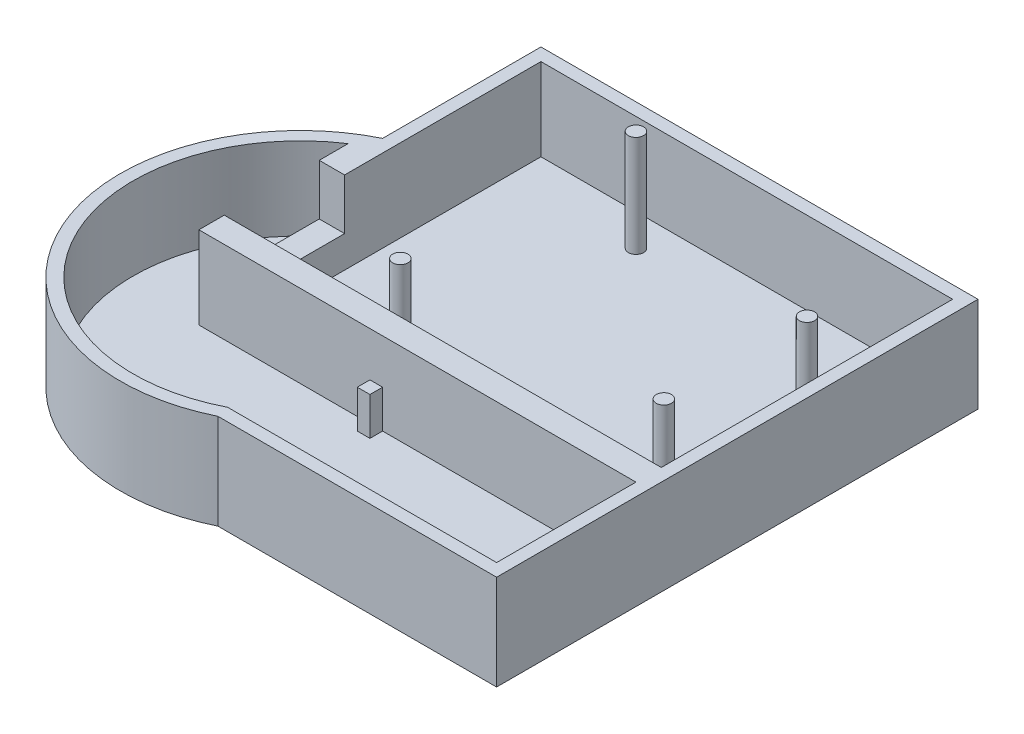
ISO-10303-21;
HEADER;
FILE_DESCRIPTION(('STEP AP214'),'2;1');
FILE_NAME('part.step','',(''),(''),'','','');
FILE_SCHEMA(('AUTOMOTIVE_DESIGN { 1 0 10303 214 1 1 1 1 }'));
ENDSEC;
DATA;
#1=APPLICATION_CONTEXT('core data for automotive mechanical design processes');
#2=APPLICATION_PROTOCOL_DEFINITION('international standard','automotive_design',2000,#1);
#3=PRODUCT_CONTEXT('',#1,'mechanical');
#4=PRODUCT('Part','Part','',(#3));
#5=PRODUCT_RELATED_PRODUCT_CATEGORY('part','',(#4));
#6=PRODUCT_DEFINITION_FORMATION('','',#4);
#7=PRODUCT_DEFINITION_CONTEXT('part definition',#1,'design');
#8=PRODUCT_DEFINITION('design','',#6,#7);
#9=PRODUCT_DEFINITION_SHAPE('','',#8);
#10=(LENGTH_UNIT() NAMED_UNIT(*) SI_UNIT(.MILLI.,.METRE.));
#11=(NAMED_UNIT(*) PLANE_ANGLE_UNIT() SI_UNIT($,.RADIAN.));
#12=(NAMED_UNIT(*) SI_UNIT($,.STERADIAN.) SOLID_ANGLE_UNIT());
#13=UNCERTAINTY_MEASURE_WITH_UNIT(LENGTH_MEASURE(1.E-05),#10,'distance_accuracy_value','');
#14=(GEOMETRIC_REPRESENTATION_CONTEXT(3) GLOBAL_UNCERTAINTY_ASSIGNED_CONTEXT((#13)) GLOBAL_UNIT_ASSIGNED_CONTEXT((#10,
#11,#12)) REPRESENTATION_CONTEXT('',''));
#15=CARTESIAN_POINT('',(0.,0.,0.));
#16=DIRECTION('',(0.,0.,1.));
#17=DIRECTION('',(1.,0.,0.));
#18=AXIS2_PLACEMENT_3D('',#15,#16,#17);
#19=CARTESIAN_POINT('',(48.768,25.4,0.));
#20=DIRECTION('',(-1.,0.,0.));
#21=DIRECTION('',(0.,0.,1.));
#22=AXIS2_PLACEMENT_3D('',#19,#20,#21);
#23=PLANE('',#22);
#24=DIRECTION('',(0.,0.,-1.));
#25=VECTOR('',#24,1.);
#26=CARTESIAN_POINT('',(48.768,19.0754,0.));
#27=LINE('',#26,#25);
#28=CARTESIAN_POINT('',(48.768,19.0754,60.96));
#29=VERTEX_POINT('',#28);
#30=CARTESIAN_POINT('',(48.768,19.0754,2.53999999999998));
#31=VERTEX_POINT('',#30);
#32=EDGE_CURVE('E208',#29,#31,#27,.T.);
#33=ORIENTED_EDGE('',*,*,#32,.T.);
#34=DIRECTION('',(0.,-1.,0.));
#35=VECTOR('',#34,1.);
#36=CARTESIAN_POINT('',(48.768,7.62,2.54000000000001));
#37=LINE('',#36,#35);
#38=CARTESIAN_POINT('',(48.768,2.54,2.54000000000001));
#39=VERTEX_POINT('',#38);
#40=EDGE_CURVE('E50',#31,#39,#37,.T.);
#41=ORIENTED_EDGE('',*,*,#40,.T.);
#42=DIRECTION('',(0.,0.,-1.));
#43=VECTOR('',#42,1.);
#44=CARTESIAN_POINT('',(48.768,2.54,0.));
#45=LINE('',#44,#43);
#46=CARTESIAN_POINT('',(48.768,2.54,60.96));
#47=VERTEX_POINT('',#46);
#48=EDGE_CURVE('E269',#47,#39,#45,.T.);
#49=ORIENTED_EDGE('',*,*,#48,.F.);
#50=DIRECTION('',(0.,-1.,0.));
#51=VECTOR('',#50,1.);
#52=CARTESIAN_POINT('',(48.768,25.4,60.96));
#53=LINE('',#52,#51);
#54=EDGE_CURVE('E271',#29,#47,#53,.T.);
#55=ORIENTED_EDGE('',*,*,#54,.F.);
#56=EDGE_LOOP('',(#33,#41,#49,#55));
#57=FACE_BOUND('',#56,.T.);
#58=ADVANCED_FACE('F35',(#57),#23,.T.);
#59=CARTESIAN_POINT('',(-20.447,0.,64.135));
#60=DIRECTION('',(0.,-1.,0.));
#61=DIRECTION('',(0.,0.,-1.));
#62=AXIS2_PLACEMENT_3D('',#59,#60,#61);
#63=PLANE('',#62);
#64=DIRECTION('',(-1.,0.,0.));
#65=VECTOR('',#64,1.);
#66=CARTESIAN_POINT('',(51.308,0.,0.));
#67=LINE('',#66,#65);
#68=CARTESIAN_POINT('',(51.308,0.,0.));
#69=VERTEX_POINT('',#68);
#70=CARTESIAN_POINT('',(-36.322,0.,0.));
#71=VERTEX_POINT('',#70);
#72=EDGE_CURVE('E270',#69,#71,#67,.T.);
#73=ORIENTED_EDGE('',*,*,#72,.F.);
#74=DIRECTION('',(0.,0.,1.));
#75=VECTOR('',#74,1.);
#76=CARTESIAN_POINT('',(51.308,0.,63.5));
#77=LINE('',#76,#75);
#78=CARTESIAN_POINT('',(51.308,0.,96.52));
#79=VERTEX_POINT('',#78);
#80=EDGE_CURVE('E195',#69,#79,#77,.T.);
#81=ORIENTED_EDGE('',*,*,#80,.T.);
#82=DIRECTION('',(1.,0.,0.));
#83=VECTOR('',#82,1.);
#84=CARTESIAN_POINT('',(-4.57199999999994,0.,96.52));
#85=LINE('',#84,#83);
#86=CARTESIAN_POINT('',(-4.57199999999995,0.,96.52));
#87=VERTEX_POINT('',#86);
#88=EDGE_CURVE('E357',#87,#79,#85,.T.);
#89=ORIENTED_EDGE('',*,*,#88,.F.);
#90=CARTESIAN_POINT('',(-20.447,0.,64.135));
#91=DIRECTION('',(0.,-1.,0.));
#92=DIRECTION('',(0.,0.,-1.));
#93=AXIS2_PLACEMENT_3D('',#90,#91,#92);
#94=CIRCLE('',#93,36.0666584257538);
#95=CARTESIAN_POINT('',(-36.322,0.,31.75));
#96=VERTEX_POINT('',#95);
#97=EDGE_CURVE('E354',#87,#96,#94,.T.);
#98=ORIENTED_EDGE('',*,*,#97,.T.);
#99=DIRECTION('',(0.,0.,1.));
#100=VECTOR('',#99,1.);
#101=CARTESIAN_POINT('',(-36.322,0.,0.));
#102=LINE('',#101,#100);
#103=EDGE_CURVE('E312',#71,#96,#102,.T.);
#104=ORIENTED_EDGE('',*,*,#103,.F.);
#105=EDGE_LOOP('',(#73,#81,#89,#98,#104));
#106=FACE_BOUND('',#105,.T.);
#107=ADVANCED_FACE('F401',(#106),#63,.T.);
#108=CARTESIAN_POINT('',(51.308,24.13,63.5));
#109=DIRECTION('',(1.,0.,0.));
#110=DIRECTION('',(0.,0.,-1.));
#111=AXIS2_PLACEMENT_3D('',#108,#109,#110);
#112=PLANE('',#111);
#113=ORIENTED_EDGE('',*,*,#80,.F.);
#114=DIRECTION('',(0.,1.,0.));
#115=VECTOR('',#114,1.);
#116=CARTESIAN_POINT('',(51.308,24.13,0.));
#117=LINE('',#116,#115);
#118=CARTESIAN_POINT('',(51.308,19.0754,0.));
#119=VERTEX_POINT('',#118);
#120=EDGE_CURVE('E180',#69,#119,#117,.T.);
#121=ORIENTED_EDGE('',*,*,#120,.T.);
#122=DIRECTION('',(0.,0.,1.));
#123=VECTOR('',#122,1.);
#124=CARTESIAN_POINT('',(51.308,19.0754,63.5));
#125=LINE('',#124,#123);
#126=CARTESIAN_POINT('',(51.308,19.0754,96.52));
#127=VERTEX_POINT('',#126);
#128=EDGE_CURVE('E193',#119,#127,#125,.T.);
#129=ORIENTED_EDGE('',*,*,#128,.T.);
#130=DIRECTION('',(0.,-1.,0.));
#131=VECTOR('',#130,1.);
#132=CARTESIAN_POINT('',(51.308,24.13,96.52));
#133=LINE('',#132,#131);
#134=EDGE_CURVE('E257',#127,#79,#133,.T.);
#135=ORIENTED_EDGE('',*,*,#134,.T.);
#136=EDGE_LOOP('',(#113,#121,#129,#135));
#137=FACE_BOUND('',#136,.T.);
#138=ADVANCED_FACE('F191',(#137),#112,.T.);
#139=CARTESIAN_POINT('',(-107.039246707051,19.0754,172.53073556711));
#140=DIRECTION('',(0.,1.,0.));
#141=DIRECTION('',(0.,0.,1.));
#142=AXIS2_PLACEMENT_3D('',#139,#140,#141);
#143=PLANE('',#142);
#144=DIRECTION('',(0.,0.,1.));
#145=VECTOR('',#144,1.);
#146=CARTESIAN_POINT('',(-36.322,19.0754,0.));
#147=LINE('',#146,#145);
#148=CARTESIAN_POINT('',(-36.322,19.0754,0.));
#149=VERTEX_POINT('',#148);
#150=CARTESIAN_POINT('',(-36.322,19.0754,31.75));
#151=VERTEX_POINT('',#150);
#152=EDGE_CURVE('E187',#149,#151,#147,.T.);
#153=ORIENTED_EDGE('',*,*,#152,.T.);
#154=CARTESIAN_POINT('',(-20.447,19.0754,64.135));
#155=DIRECTION('',(0.,1.,0.));
#156=DIRECTION('',(0.,0.,1.));
#157=AXIS2_PLACEMENT_3D('',#154,#155,#156);
#158=CIRCLE('',#157,36.0666584257538);
#159=CARTESIAN_POINT('',(-4.57199999999995,19.0754,96.52));
#160=VERTEX_POINT('',#159);
#161=EDGE_CURVE('E202',#160,#151,#158,.F.);
#162=ORIENTED_EDGE('',*,*,#161,.F.);
#163=DIRECTION('',(1.,0.,0.));
#164=VECTOR('',#163,1.);
#165=CARTESIAN_POINT('',(-4.57199999999994,19.0754,96.52));
#166=LINE('',#165,#164);
#167=EDGE_CURVE('E188',#160,#127,#166,.T.);
#168=ORIENTED_EDGE('',*,*,#167,.T.);
#169=ORIENTED_EDGE('',*,*,#128,.F.);
#170=DIRECTION('',(-1.,0.,0.));
#171=VECTOR('',#170,1.);
#172=CARTESIAN_POINT('',(51.308,19.0754,0.));
#173=LINE('',#172,#171);
#174=EDGE_CURVE('E177',#119,#149,#173,.T.);
#175=ORIENTED_EDGE('',*,*,#174,.T.);
#176=EDGE_LOOP('',(#153,#162,#168,#169,#175));
#177=FACE_BOUND('',#176,.T.);
#178=DIRECTION('',(-1.,0.,0.));
#179=VECTOR('',#178,1.);
#180=CARTESIAN_POINT('',(51.308,19.0754,2.53999999999999));
#181=LINE('',#180,#179);
#182=CARTESIAN_POINT('',(-33.782,19.0754,2.54000000000001));
#183=VERTEX_POINT('',#182);
#184=EDGE_CURVE('E214',#31,#183,#181,.T.);
#185=ORIENTED_EDGE('',*,*,#184,.F.);
#186=ORIENTED_EDGE('',*,*,#32,.F.);
#187=DIRECTION('',(-1.,0.,0.));
#188=VECTOR('',#187,1.);
#189=CARTESIAN_POINT('',(-56.5146584257538,19.0754,60.96));
#190=LINE('',#189,#188);
#191=CARTESIAN_POINT('',(-38.862,19.0754,60.96));
#192=VERTEX_POINT('',#191);
#193=EDGE_CURVE('E232',#29,#192,#190,.T.);
#194=ORIENTED_EDGE('',*,*,#193,.T.);
#195=DIRECTION('',(0.,0.,-1.));
#196=VECTOR('',#195,1.);
#197=CARTESIAN_POINT('',(-38.862,19.0754,63.5));
#198=LINE('',#197,#196);
#199=CARTESIAN_POINT('',(-38.862,19.0754,66.04));
#200=VERTEX_POINT('',#199);
#201=EDGE_CURVE('E217',#200,#192,#198,.T.);
#202=ORIENTED_EDGE('',*,*,#201,.F.);
#203=DIRECTION('',(1.,0.,0.));
#204=VECTOR('',#203,1.);
#205=CARTESIAN_POINT('',(-4.57199999999994,19.0754,66.04));
#206=LINE('',#205,#204);
#207=CARTESIAN_POINT('',(48.768,19.0754,66.04));
#208=VERTEX_POINT('',#207);
#209=EDGE_CURVE('E229',#200,#208,#206,.T.);
#210=ORIENTED_EDGE('',*,*,#209,.T.);
#211=DIRECTION('',(0.,0.,1.));
#212=VECTOR('',#211,1.);
#213=CARTESIAN_POINT('',(48.768,19.0754,63.5));
#214=LINE('',#213,#212);
#215=CARTESIAN_POINT('',(48.768,19.0754,93.98));
#216=VERTEX_POINT('',#215);
#217=EDGE_CURVE('E226',#208,#216,#214,.T.);
#218=ORIENTED_EDGE('',*,*,#217,.T.);
#219=DIRECTION('',(1.,0.,0.));
#220=VECTOR('',#219,1.);
#221=CARTESIAN_POINT('',(-4.57199999999994,19.0754,93.98));
#222=LINE('',#221,#220);
#223=CARTESIAN_POINT('',(-5.17241980291502,19.0754,93.98));
#224=VERTEX_POINT('',#223);
#225=EDGE_CURVE('E220',#224,#216,#222,.T.);
#226=ORIENTED_EDGE('',*,*,#225,.F.);
#227=CARTESIAN_POINT('',(-20.447,19.0754,64.135));
#228=DIRECTION('',(0.,1.,0.));
#229=DIRECTION('',(0.,0.,1.));
#230=AXIS2_PLACEMENT_3D('',#227,#228,#229);
#231=CIRCLE('',#230,33.5266584257538);
#232=CARTESIAN_POINT('',(-38.862,19.0754,36.1184941472501));
#233=VERTEX_POINT('',#232);
#234=EDGE_CURVE('E223',#224,#233,#231,.F.);
#235=ORIENTED_EDGE('',*,*,#234,.T.);
#236=CARTESIAN_POINT('',(-38.862,19.0754,41.91));
#237=VERTEX_POINT('',#236);
#238=EDGE_CURVE('E216',#237,#233,#198,.T.);
#239=ORIENTED_EDGE('',*,*,#238,.F.);
#240=DIRECTION('',(1.,0.,0.));
#241=VECTOR('',#240,1.);
#242=CARTESIAN_POINT('',(-56.5146584257538,19.0754,41.91));
#243=LINE('',#242,#241);
#244=CARTESIAN_POINT('',(-33.782,19.0754,41.91));
#245=VERTEX_POINT('',#244);
#246=EDGE_CURVE('E235',#237,#245,#243,.T.);
#247=ORIENTED_EDGE('',*,*,#246,.T.);
#248=DIRECTION('',(0.,0.,1.));
#249=VECTOR('',#248,1.);
#250=CARTESIAN_POINT('',(-33.782,19.0754,0.));
#251=LINE('',#250,#249);
#252=EDGE_CURVE('E203',#183,#245,#251,.T.);
#253=ORIENTED_EDGE('',*,*,#252,.F.);
#254=EDGE_LOOP('',(#185,#186,#194,#202,#210,#218,#226,#235,#239,#247,#253));
#255=FACE_BOUND('',#254,.T.);
#256=ADVANCED_FACE('F198',(#177,#255),#143,.T.);
#257=CARTESIAN_POINT('',(-2.03199999999999,10.16,68.58));
#258=DIRECTION('',(0.,0.,1.));
#259=DIRECTION('',(1.,0.,0.));
#260=AXIS2_PLACEMENT_3D('',#257,#258,#259);
#261=PLANE('',#260);
#262=DIRECTION('',(-1.,0.,0.));
#263=VECTOR('',#262,1.);
#264=CARTESIAN_POINT('',(-2.03199999999999,2.54,68.58));
#265=LINE('',#264,#263);
#266=CARTESIAN_POINT('',(-2.03199999999999,2.54,68.58));
#267=VERTEX_POINT('',#266);
#268=CARTESIAN_POINT('',(-4.57199999999999,2.54,68.58));
#269=VERTEX_POINT('',#268);
#270=EDGE_CURVE('E334',#267,#269,#265,.T.);
#271=ORIENTED_EDGE('',*,*,#270,.F.);
#272=DIRECTION('',(0.,-1.,0.));
#273=VECTOR('',#272,1.);
#274=CARTESIAN_POINT('',(-2.03199999999999,10.16,68.58));
#275=LINE('',#274,#273);
#276=CARTESIAN_POINT('',(-2.03199999999999,10.16,68.58));
#277=VERTEX_POINT('',#276);
#278=EDGE_CURVE('E343',#277,#267,#275,.T.);
#279=ORIENTED_EDGE('',*,*,#278,.F.);
#280=DIRECTION('',(-1.,0.,0.));
#281=VECTOR('',#280,1.);
#282=CARTESIAN_POINT('',(-2.03199999999999,10.16,68.58));
#283=LINE('',#282,#281);
#284=CARTESIAN_POINT('',(-4.57199999999999,10.16,68.58));
#285=VERTEX_POINT('',#284);
#286=EDGE_CURVE('E322',#277,#285,#283,.T.);
#287=ORIENTED_EDGE('',*,*,#286,.T.);
#288=DIRECTION('',(0.,-1.,0.));
#289=VECTOR('',#288,1.);
#290=CARTESIAN_POINT('',(-4.57199999999999,10.16,68.58));
#291=LINE('',#290,#289);
#292=EDGE_CURVE('E346',#285,#269,#291,.T.);
#293=ORIENTED_EDGE('',*,*,#292,.T.);
#294=EDGE_LOOP('',(#271,#279,#287,#293));
#295=FACE_BOUND('',#294,.T.);
#296=ADVANCED_FACE('F425',(#295),#261,.T.);
#297=CARTESIAN_POINT('',(-4.57199999999994,24.13,93.98));
#298=DIRECTION('',(0.,0.,-1.));
#299=DIRECTION('',(-1.,0.,0.));
#300=AXIS2_PLACEMENT_3D('',#297,#298,#299);
#301=PLANE('',#300);
#302=DIRECTION('',(0.,-1.,0.));
#303=VECTOR('',#302,1.);
#304=CARTESIAN_POINT('',(-5.17241980291502,21.59,93.98));
#305=LINE('',#304,#303);
#306=CARTESIAN_POINT('',(-5.17241980291502,2.54,93.98));
#307=VERTEX_POINT('',#306);
#308=EDGE_CURVE('E247',#224,#307,#305,.T.);
#309=ORIENTED_EDGE('',*,*,#308,.F.);
#310=ORIENTED_EDGE('',*,*,#225,.T.);
#311=DIRECTION('',(0.,-1.,0.));
#312=VECTOR('',#311,1.);
#313=CARTESIAN_POINT('',(48.768,24.13,93.98));
#314=LINE('',#313,#312);
#315=CARTESIAN_POINT('',(48.768,2.54,93.98));
#316=VERTEX_POINT('',#315);
#317=EDGE_CURVE('E244',#216,#316,#314,.T.);
#318=ORIENTED_EDGE('',*,*,#317,.T.);
#319=DIRECTION('',(1.,0.,0.));
#320=VECTOR('',#319,1.);
#321=CARTESIAN_POINT('',(-20.447,2.54,93.98));
#322=LINE('',#321,#320);
#323=EDGE_CURVE('E249',#307,#316,#322,.T.);
#324=ORIENTED_EDGE('',*,*,#323,.F.);
#325=EDGE_LOOP('',(#309,#310,#318,#324));
#326=FACE_BOUND('',#325,.T.);
#327=ADVANCED_FACE('F430',(#326),#301,.T.);
#328=CARTESIAN_POINT('',(48.768,24.13,63.5));
#329=DIRECTION('',(1.,0.,0.));
#330=DIRECTION('',(0.,0.,-1.));
#331=AXIS2_PLACEMENT_3D('',#328,#329,#330);
#332=PLANE('',#331);
#333=ORIENTED_EDGE('',*,*,#217,.F.);
#334=DIRECTION('',(0.,-1.,0.));
#335=VECTOR('',#334,1.);
#336=CARTESIAN_POINT('',(48.768,24.13,66.04));
#337=LINE('',#336,#335);
#338=CARTESIAN_POINT('',(48.768,2.54,66.04));
#339=VERTEX_POINT('',#338);
#340=EDGE_CURVE('E242',#208,#339,#337,.T.);
#341=ORIENTED_EDGE('',*,*,#340,.T.);
#342=DIRECTION('',(0.,0.,1.));
#343=VECTOR('',#342,1.);
#344=CARTESIAN_POINT('',(48.768,2.54,64.135));
#345=LINE('',#344,#343);
#346=EDGE_CURVE('E363',#339,#316,#345,.T.);
#347=ORIENTED_EDGE('',*,*,#346,.T.);
#348=ORIENTED_EDGE('',*,*,#317,.F.);
#349=EDGE_LOOP('',(#333,#341,#347,#348));
#350=FACE_BOUND('',#349,.T.);
#351=ADVANCED_FACE('F447',(#350),#332,.F.);
#352=CARTESIAN_POINT('',(-2.03199999999999,10.16,66.04));
#353=DIRECTION('',(1.,0.,0.));
#354=DIRECTION('',(0.,0.,-1.));
#355=AXIS2_PLACEMENT_3D('',#352,#353,#354);
#356=PLANE('',#355);
#357=DIRECTION('',(0.,0.,1.));
#358=VECTOR('',#357,1.);
#359=CARTESIAN_POINT('',(-2.03199999999999,2.54,66.04));
#360=LINE('',#359,#358);
#361=CARTESIAN_POINT('',(-2.03199999999999,2.54,66.04));
#362=VERTEX_POINT('',#361);
#363=EDGE_CURVE('E321',#362,#267,#360,.T.);
#364=ORIENTED_EDGE('',*,*,#363,.F.);
#365=DIRECTION('',(0.,-1.,0.));
#366=VECTOR('',#365,1.);
#367=CARTESIAN_POINT('',(-2.03199999999999,10.16,66.04));
#368=LINE('',#367,#366);
#369=CARTESIAN_POINT('',(-2.03199999999999,10.16,66.04));
#370=VERTEX_POINT('',#369);
#371=EDGE_CURVE('E340',#370,#362,#368,.T.);
#372=ORIENTED_EDGE('',*,*,#371,.F.);
#373=DIRECTION('',(0.,0.,1.));
#374=VECTOR('',#373,1.);
#375=CARTESIAN_POINT('',(-2.03199999999999,10.16,66.04));
#376=LINE('',#375,#374);
#377=EDGE_CURVE('E325',#370,#277,#376,.T.);
#378=ORIENTED_EDGE('',*,*,#377,.T.);
#379=ORIENTED_EDGE('',*,*,#278,.T.);
#380=EDGE_LOOP('',(#364,#372,#378,#379));
#381=FACE_BOUND('',#380,.T.);
#382=ADVANCED_FACE('F451',(#381),#356,.T.);
#383=CARTESIAN_POINT('',(0.,10.16,0.));
#384=DIRECTION('',(0.,-1.,0.));
#385=DIRECTION('',(-1.,0.,0.));
#386=AXIS2_PLACEMENT_3D('',#383,#384,#385);
#387=PLANE('',#386);
#388=DIRECTION('',(0.,0.,1.));
#389=VECTOR('',#388,1.);
#390=CARTESIAN_POINT('',(-4.57199999999999,10.16,66.04));
#391=LINE('',#390,#389);
#392=CARTESIAN_POINT('',(-4.57199999999999,10.16,66.04));
#393=VERTEX_POINT('',#392);
#394=EDGE_CURVE('E319',#393,#285,#391,.T.);
#395=ORIENTED_EDGE('',*,*,#394,.T.);
#396=ORIENTED_EDGE('',*,*,#286,.F.);
#397=ORIENTED_EDGE('',*,*,#377,.F.);
#398=DIRECTION('',(1.,0.,0.));
#399=VECTOR('',#398,1.);
#400=CARTESIAN_POINT('',(-4.57199999999999,10.16,66.04));
#401=LINE('',#400,#399);
#402=EDGE_CURVE('E328',#393,#370,#401,.T.);
#403=ORIENTED_EDGE('',*,*,#402,.F.);
#404=EDGE_LOOP('',(#395,#396,#397,#403));
#405=FACE_BOUND('',#404,.T.);
#406=ADVANCED_FACE('F675',(#405),#387,.F.);
#407=CARTESIAN_POINT('',(-4.57199999999999,10.16,66.04));
#408=DIRECTION('',(1.,0.,0.));
#409=DIRECTION('',(0.,0.,-1.));
#410=AXIS2_PLACEMENT_3D('',#407,#408,#409);
#411=PLANE('',#410);
#412=DIRECTION('',(0.,0.,1.));
#413=VECTOR('',#412,1.);
#414=CARTESIAN_POINT('',(-4.57199999999999,2.54,66.04));
#415=LINE('',#414,#413);
#416=CARTESIAN_POINT('',(-4.57199999999999,2.54,66.04));
#417=VERTEX_POINT('',#416);
#418=EDGE_CURVE('E316',#417,#269,#415,.T.);
#419=ORIENTED_EDGE('',*,*,#418,.T.);
#420=ORIENTED_EDGE('',*,*,#292,.F.);
#421=ORIENTED_EDGE('',*,*,#394,.F.);
#422=DIRECTION('',(0.,-1.,0.));
#423=VECTOR('',#422,1.);
#424=CARTESIAN_POINT('',(-4.57199999999999,10.16,66.04));
#425=LINE('',#424,#423);
#426=EDGE_CURVE('E331',#393,#417,#425,.T.);
#427=ORIENTED_EDGE('',*,*,#426,.T.);
#428=EDGE_LOOP('',(#419,#420,#421,#427));
#429=FACE_BOUND('',#428,.T.);
#430=ADVANCED_FACE('F673',(#429),#411,.F.);
#431=CARTESIAN_POINT('',(-20.447,2.54,64.135));
#432=DIRECTION('',(0.,-1.,0.));
#433=DIRECTION('',(0.,0.,-1.));
#434=AXIS2_PLACEMENT_3D('',#431,#432,#433);
#435=PLANE('',#434);
#436=ORIENTED_EDGE('',*,*,#418,.F.);
#437=DIRECTION('',(1.,0.,0.));
#438=VECTOR('',#437,1.);
#439=CARTESIAN_POINT('',(-20.447,2.54,66.04));
#440=LINE('',#439,#438);
#441=CARTESIAN_POINT('',(-38.862,2.54,66.04));
#442=VERTEX_POINT('',#441);
#443=EDGE_CURVE('E366',#442,#417,#440,.T.);
#444=ORIENTED_EDGE('',*,*,#443,.F.);
#445=DIRECTION('',(0.,0.,-1.));
#446=VECTOR('',#445,1.);
#447=CARTESIAN_POINT('',(-38.862,2.54,64.135));
#448=LINE('',#447,#446);
#449=CARTESIAN_POINT('',(-38.862,2.54,36.1184941472501));
#450=VERTEX_POINT('',#449);
#451=EDGE_CURVE('E254',#442,#450,#448,.T.);
#452=ORIENTED_EDGE('',*,*,#451,.T.);
#453=CARTESIAN_POINT('',(-20.447,2.54,64.135));
#454=DIRECTION('',(0.,-1.,0.));
#455=DIRECTION('',(0.,0.,-1.));
#456=AXIS2_PLACEMENT_3D('',#453,#454,#455);
#457=CIRCLE('',#456,33.5266584257538);
#458=EDGE_CURVE('E241',#307,#450,#457,.T.);
#459=ORIENTED_EDGE('',*,*,#458,.F.);
#460=ORIENTED_EDGE('',*,*,#323,.T.);
#461=ORIENTED_EDGE('',*,*,#346,.F.);
#462=EDGE_CURVE('E245',#362,#339,#440,.T.);
#463=ORIENTED_EDGE('',*,*,#462,.F.);
#464=ORIENTED_EDGE('',*,*,#363,.T.);
#465=ORIENTED_EDGE('',*,*,#270,.T.);
#466=EDGE_LOOP('',(#436,#444,#452,#459,#460,#461,#463,#464,#465));
#467=FACE_BOUND('',#466,.T.);
#468=ADVANCED_FACE('F443',(#467),#435,.F.);
#469=CARTESIAN_POINT('',(-20.447,24.13,64.135));
#470=DIRECTION('',(0.,-1.,0.));
#471=DIRECTION('',(0.,0.,-1.));
#472=AXIS2_PLACEMENT_3D('',#469,#470,#471);
#473=CYLINDRICAL_SURFACE('',#472,33.5266584257538);
#474=ORIENTED_EDGE('',*,*,#234,.F.);
#475=ORIENTED_EDGE('',*,*,#308,.T.);
#476=ORIENTED_EDGE('',*,*,#458,.T.);
#477=DIRECTION('',(0.,-1.,0.));
#478=VECTOR('',#477,1.);
#479=CARTESIAN_POINT('',(-38.862,21.59,36.1184941472501));
#480=LINE('',#479,#478);
#481=EDGE_CURVE('E250',#233,#450,#480,.T.);
#482=ORIENTED_EDGE('',*,*,#481,.F.);
#483=EDGE_LOOP('',(#474,#475,#476,#482));
#484=FACE_BOUND('',#483,.T.);
#485=ADVANCED_FACE('F440',(#484),#473,.F.);
#486=CARTESIAN_POINT('',(-4.57199999999994,24.13,66.04));
#487=DIRECTION('',(0.,0.,-1.));
#488=DIRECTION('',(-1.,0.,0.));
#489=AXIS2_PLACEMENT_3D('',#486,#487,#488);
#490=PLANE('',#489);
#491=ORIENTED_EDGE('',*,*,#209,.F.);
#492=DIRECTION('',(0.,-1.,0.));
#493=VECTOR('',#492,1.);
#494=CARTESIAN_POINT('',(-38.862,24.13,66.04));
#495=LINE('',#494,#493);
#496=EDGE_CURVE('E252',#200,#442,#495,.T.);
#497=ORIENTED_EDGE('',*,*,#496,.T.);
#498=ORIENTED_EDGE('',*,*,#443,.T.);
#499=ORIENTED_EDGE('',*,*,#426,.F.);
#500=ORIENTED_EDGE('',*,*,#402,.T.);
#501=ORIENTED_EDGE('',*,*,#371,.T.);
#502=ORIENTED_EDGE('',*,*,#462,.T.);
#503=ORIENTED_EDGE('',*,*,#340,.F.);
#504=EDGE_LOOP('',(#491,#497,#498,#499,#500,#501,#502,#503));
#505=FACE_BOUND('',#504,.T.);
#506=ADVANCED_FACE('F438',(#505),#490,.F.);
#507=CARTESIAN_POINT('',(-38.862,24.13,63.5));
#508=DIRECTION('',(-1.,0.,0.));
#509=DIRECTION('',(0.,0.,1.));
#510=AXIS2_PLACEMENT_3D('',#507,#508,#509);
#511=PLANE('',#510);
#512=ORIENTED_EDGE('',*,*,#496,.F.);
#513=ORIENTED_EDGE('',*,*,#201,.T.);
#514=DIRECTION('',(0.,-1.,0.));
#515=VECTOR('',#514,1.);
#516=CARTESIAN_POINT('',(-38.862,21.59,60.96));
#517=LINE('',#516,#515);
#518=CARTESIAN_POINT('',(-38.862,8.89,60.96));
#519=VERTEX_POINT('',#518);
#520=EDGE_CURVE('E259',#192,#519,#517,.T.);
#521=ORIENTED_EDGE('',*,*,#520,.T.);
#522=DIRECTION('',(0.,0.,-1.));
#523=VECTOR('',#522,1.);
#524=CARTESIAN_POINT('',(-38.862,8.89,60.96));
#525=LINE('',#524,#523);
#526=CARTESIAN_POINT('',(-38.862,8.89,41.91));
#527=VERTEX_POINT('',#526);
#528=EDGE_CURVE('E348',#519,#527,#525,.T.);
#529=ORIENTED_EDGE('',*,*,#528,.T.);
#530=DIRECTION('',(0.,1.,0.));
#531=VECTOR('',#530,1.);
#532=CARTESIAN_POINT('',(-38.862,8.89,41.91));
#533=LINE('',#532,#531);
#534=EDGE_CURVE('E261',#527,#237,#533,.T.);
#535=ORIENTED_EDGE('',*,*,#534,.T.);
#536=ORIENTED_EDGE('',*,*,#238,.T.);
#537=ORIENTED_EDGE('',*,*,#481,.T.);
#538=ORIENTED_EDGE('',*,*,#451,.F.);
#539=EDGE_LOOP('',(#512,#513,#521,#529,#535,#536,#537,#538));
#540=FACE_BOUND('',#539,.T.);
#541=ADVANCED_FACE('F435',(#540),#511,.T.);
#542=CARTESIAN_POINT('',(2.54,7.62,0.));
#543=DIRECTION('',(0.,0.,1.));
#544=DIRECTION('',(1.,0.,0.));
#545=AXIS2_PLACEMENT_3D('',#542,#543,#544);
#546=PLANE('',#545);
#547=ORIENTED_EDGE('',*,*,#174,.F.);
#548=ORIENTED_EDGE('',*,*,#120,.F.);
#549=ORIENTED_EDGE('',*,*,#72,.T.);
#550=DIRECTION('',(0.,-1.,0.));
#551=VECTOR('',#550,1.);
#552=CARTESIAN_POINT('',(-36.322,29.21,0.));
#553=LINE('',#552,#551);
#554=EDGE_CURVE('E183',#149,#71,#553,.T.);
#555=ORIENTED_EDGE('',*,*,#554,.F.);
#556=EDGE_LOOP('',(#547,#548,#549,#555));
#557=FACE_BOUND('',#556,.T.);
#558=ADVANCED_FACE('F179',(#557),#546,.F.);
#559=CARTESIAN_POINT('',(0.,2.54,0.));
#560=DIRECTION('',(0.,-1.,0.));
#561=DIRECTION('',(0.,0.,-1.));
#562=AXIS2_PLACEMENT_3D('',#559,#560,#561);
#563=PLANE('',#562);
#564=CARTESIAN_POINT('',(-9.906,2.54,54.61));
#565=DIRECTION('',(0.,-1.,0.));
#566=DIRECTION('',(0.,0.,-1.));
#567=AXIS2_PLACEMENT_3D('',#564,#565,#566);
#568=CIRCLE('',#567,1.524);
#569=CARTESIAN_POINT('',(-9.906,2.54,53.086));
#570=VERTEX_POINT('',#569);
#571=EDGE_CURVE('E11',#570,#570,#568,.F.);
#572=ORIENTED_EDGE('',*,*,#571,.F.);
#573=EDGE_LOOP('',(#572));
#574=FACE_BOUND('',#573,.T.);
#575=CARTESIAN_POINT('',(-8.38199999999999,2.54,8.89000000000001));
#576=DIRECTION('',(0.,-1.,0.));
#577=DIRECTION('',(0.,0.,-1.));
#578=AXIS2_PLACEMENT_3D('',#575,#576,#577);
#579=CIRCLE('',#578,1.52400000000001);
#580=CARTESIAN_POINT('',(-8.38199999999999,2.54,7.366));
#581=VERTEX_POINT('',#580);
#582=EDGE_CURVE('E43',#581,#581,#579,.F.);
#583=ORIENTED_EDGE('',*,*,#582,.F.);
#584=EDGE_LOOP('',(#583));
#585=FACE_BOUND('',#584,.T.);
#586=CARTESIAN_POINT('',(40.894,2.54,23.876));
#587=DIRECTION('',(0.,-1.,0.));
#588=DIRECTION('',(0.,0.,-1.));
#589=AXIS2_PLACEMENT_3D('',#586,#587,#588);
#590=CIRCLE('',#589,1.524);
#591=CARTESIAN_POINT('',(40.894,2.54,22.352));
#592=VERTEX_POINT('',#591);
#593=EDGE_CURVE('E282',#592,#592,#590,.F.);
#594=ORIENTED_EDGE('',*,*,#593,.F.);
#595=EDGE_LOOP('',(#594));
#596=FACE_BOUND('',#595,.T.);
#597=CARTESIAN_POINT('',(40.894,2.54,52.578));
#598=DIRECTION('',(0.,-1.,0.));
#599=DIRECTION('',(0.,0.,-1.));
#600=AXIS2_PLACEMENT_3D('',#597,#598,#599);
#601=CIRCLE('',#600,1.524);
#602=CARTESIAN_POINT('',(40.894,2.54,51.054));
#603=VERTEX_POINT('',#602);
#604=EDGE_CURVE('E279',#603,#603,#601,.F.);
#605=ORIENTED_EDGE('',*,*,#604,.F.);
#606=EDGE_LOOP('',(#605));
#607=FACE_BOUND('',#606,.T.);
#608=ORIENTED_EDGE('',*,*,#48,.T.);
#609=DIRECTION('',(-1.,0.,0.));
#610=VECTOR('',#609,1.);
#611=CARTESIAN_POINT('',(0.,2.54,2.54));
#612=LINE('',#611,#610);
#613=CARTESIAN_POINT('',(-33.782,2.54,2.54000000000001));
#614=VERTEX_POINT('',#613);
#615=EDGE_CURVE('E55',#39,#614,#612,.T.);
#616=ORIENTED_EDGE('',*,*,#615,.T.);
#617=DIRECTION('',(0.,0.,1.));
#618=VECTOR('',#617,1.);
#619=CARTESIAN_POINT('',(-33.782,2.54,0.));
#620=LINE('',#619,#618);
#621=CARTESIAN_POINT('',(-33.782,2.54,60.96));
#622=VERTEX_POINT('',#621);
#623=EDGE_CURVE('E276',#614,#622,#620,.T.);
#624=ORIENTED_EDGE('',*,*,#623,.T.);
#625=DIRECTION('',(1.,0.,0.));
#626=VECTOR('',#625,1.);
#627=CARTESIAN_POINT('',(0.,2.54,60.96));
#628=LINE('',#627,#626);
#629=EDGE_CURVE('E275',#622,#47,#628,.T.);
#630=ORIENTED_EDGE('',*,*,#629,.T.);
#631=EDGE_LOOP('',(#608,#616,#624,#630));
#632=FACE_BOUND('',#631,.T.);
#633=ADVANCED_FACE('F289',(#574,#585,#596,#607,#632),#563,.F.);
#634=CARTESIAN_POINT('',(-56.5146584257538,21.59,60.96));
#635=DIRECTION('',(0.,0.,1.));
#636=DIRECTION('',(1.,0.,0.));
#637=AXIS2_PLACEMENT_3D('',#634,#635,#636);
#638=PLANE('',#637);
#639=ORIENTED_EDGE('',*,*,#193,.F.);
#640=ORIENTED_EDGE('',*,*,#54,.T.);
#641=ORIENTED_EDGE('',*,*,#629,.F.);
#642=DIRECTION('',(0.,-1.,0.));
#643=VECTOR('',#642,1.);
#644=CARTESIAN_POINT('',(-33.782,29.21,60.96));
#645=LINE('',#644,#643);
#646=CARTESIAN_POINT('',(-33.782,8.89,60.96));
#647=VERTEX_POINT('',#646);
#648=EDGE_CURVE('E277',#647,#622,#645,.T.);
#649=ORIENTED_EDGE('',*,*,#648,.F.);
#650=DIRECTION('',(1.,0.,0.));
#651=VECTOR('',#650,1.);
#652=CARTESIAN_POINT('',(-56.5146584257538,8.89,60.96));
#653=LINE('',#652,#651);
#654=EDGE_CURVE('E262',#519,#647,#653,.T.);
#655=ORIENTED_EDGE('',*,*,#654,.F.);
#656=ORIENTED_EDGE('',*,*,#520,.F.);
#657=EDGE_LOOP('',(#639,#640,#641,#649,#655,#656));
#658=FACE_BOUND('',#657,.T.);
#659=ADVANCED_FACE('F292',(#658),#638,.F.);
#660=CARTESIAN_POINT('',(-56.5146584257538,8.89,60.96));
#661=DIRECTION('',(0.,-1.,0.));
#662=DIRECTION('',(0.,0.,-1.));
#663=AXIS2_PLACEMENT_3D('',#660,#661,#662);
#664=PLANE('',#663);
#665=ORIENTED_EDGE('',*,*,#654,.T.);
#666=DIRECTION('',(0.,0.,1.));
#667=VECTOR('',#666,1.);
#668=CARTESIAN_POINT('',(-33.782,8.89,41.91));
#669=LINE('',#668,#667);
#670=CARTESIAN_POINT('',(-33.782,8.89,41.91));
#671=VERTEX_POINT('',#670);
#672=EDGE_CURVE('E267',#671,#647,#669,.T.);
#673=ORIENTED_EDGE('',*,*,#672,.F.);
#674=DIRECTION('',(1.,0.,0.));
#675=VECTOR('',#674,1.);
#676=CARTESIAN_POINT('',(-56.5146584257538,8.89,41.91));
#677=LINE('',#676,#675);
#678=EDGE_CURVE('E264',#527,#671,#677,.T.);
#679=ORIENTED_EDGE('',*,*,#678,.F.);
#680=ORIENTED_EDGE('',*,*,#528,.F.);
#681=EDGE_LOOP('',(#665,#673,#679,#680));
#682=FACE_BOUND('',#681,.T.);
#683=ADVANCED_FACE('F458',(#682),#664,.F.);
#684=CARTESIAN_POINT('',(-56.5146584257538,8.89,41.91));
#685=DIRECTION('',(0.,0.,-1.));
#686=DIRECTION('',(-1.,0.,0.));
#687=AXIS2_PLACEMENT_3D('',#684,#685,#686);
#688=PLANE('',#687);
#689=ORIENTED_EDGE('',*,*,#246,.F.);
#690=ORIENTED_EDGE('',*,*,#534,.F.);
#691=ORIENTED_EDGE('',*,*,#678,.T.);
#692=DIRECTION('',(0.,-1.,0.));
#693=VECTOR('',#692,1.);
#694=CARTESIAN_POINT('',(-33.782,21.59,41.91));
#695=LINE('',#694,#693);
#696=EDGE_CURVE('E265',#245,#671,#695,.T.);
#697=ORIENTED_EDGE('',*,*,#696,.F.);
#698=EDGE_LOOP('',(#689,#690,#691,#697));
#699=FACE_BOUND('',#698,.T.);
#700=ADVANCED_FACE('F460',(#699),#688,.F.);
#701=CARTESIAN_POINT('',(51.308,29.21,2.53999999999999));
#702=DIRECTION('',(0.,0.,1.));
#703=DIRECTION('',(1.,0.,0.));
#704=AXIS2_PLACEMENT_3D('',#701,#702,#703);
#705=PLANE('',#704);
#706=ORIENTED_EDGE('',*,*,#40,.F.);
#707=ORIENTED_EDGE('',*,*,#184,.T.);
#708=DIRECTION('',(0.,-1.,0.));
#709=VECTOR('',#708,1.);
#710=CARTESIAN_POINT('',(-33.782,29.21,2.54000000000001));
#711=LINE('',#710,#709);
#712=EDGE_CURVE('E273',#183,#614,#711,.T.);
#713=ORIENTED_EDGE('',*,*,#712,.T.);
#714=ORIENTED_EDGE('',*,*,#615,.F.);
#715=EDGE_LOOP('',(#706,#707,#713,#714));
#716=FACE_BOUND('',#715,.T.);
#717=ADVANCED_FACE('F410',(#716),#705,.T.);
#718=CARTESIAN_POINT('',(-36.322,29.21,0.));
#719=DIRECTION('',(1.,0.,0.));
#720=DIRECTION('',(0.,0.,-1.));
#721=AXIS2_PLACEMENT_3D('',#718,#719,#720);
#722=PLANE('',#721);
#723=DIRECTION('',(0.,-1.,0.));
#724=VECTOR('',#723,1.);
#725=CARTESIAN_POINT('',(-36.322,24.13,31.75));
#726=LINE('',#725,#724);
#727=EDGE_CURVE('E206',#151,#96,#726,.T.);
#728=ORIENTED_EDGE('',*,*,#727,.F.);
#729=ORIENTED_EDGE('',*,*,#152,.F.);
#730=ORIENTED_EDGE('',*,*,#554,.T.);
#731=ORIENTED_EDGE('',*,*,#103,.T.);
#732=EDGE_LOOP('',(#728,#729,#730,#731));
#733=FACE_BOUND('',#732,.T.);
#734=ADVANCED_FACE('F419',(#733),#722,.F.);
#735=CARTESIAN_POINT('',(-4.57199999999994,24.13,96.52));
#736=DIRECTION('',(0.,0.,-1.));
#737=DIRECTION('',(-1.,0.,0.));
#738=AXIS2_PLACEMENT_3D('',#735,#736,#737);
#739=PLANE('',#738);
#740=ORIENTED_EDGE('',*,*,#167,.F.);
#741=DIRECTION('',(0.,-1.,0.));
#742=VECTOR('',#741,1.);
#743=CARTESIAN_POINT('',(-4.57199999999995,24.13,96.52));
#744=LINE('',#743,#742);
#745=EDGE_CURVE('E255',#160,#87,#744,.T.);
#746=ORIENTED_EDGE('',*,*,#745,.T.);
#747=ORIENTED_EDGE('',*,*,#88,.T.);
#748=ORIENTED_EDGE('',*,*,#134,.F.);
#749=EDGE_LOOP('',(#740,#746,#747,#748));
#750=FACE_BOUND('',#749,.T.);
#751=ADVANCED_FACE('F417',(#750),#739,.F.);
#752=CARTESIAN_POINT('',(-20.447,24.13,64.135));
#753=DIRECTION('',(0.,-1.,0.));
#754=DIRECTION('',(0.,0.,-1.));
#755=AXIS2_PLACEMENT_3D('',#752,#753,#754);
#756=CYLINDRICAL_SURFACE('',#755,36.0666584257538);
#757=ORIENTED_EDGE('',*,*,#745,.F.);
#758=ORIENTED_EDGE('',*,*,#161,.T.);
#759=ORIENTED_EDGE('',*,*,#727,.T.);
#760=ORIENTED_EDGE('',*,*,#97,.F.);
#761=EDGE_LOOP('',(#757,#758,#759,#760));
#762=FACE_BOUND('',#761,.T.);
#763=ADVANCED_FACE('F37',(#762),#756,.T.);
#764=CARTESIAN_POINT('',(-33.782,29.21,0.));
#765=DIRECTION('',(1.,0.,0.));
#766=DIRECTION('',(0.,0.,-1.));
#767=AXIS2_PLACEMENT_3D('',#764,#765,#766);
#768=PLANE('',#767);
#769=ORIENTED_EDGE('',*,*,#712,.F.);
#770=ORIENTED_EDGE('',*,*,#252,.T.);
#771=ORIENTED_EDGE('',*,*,#696,.T.);
#772=ORIENTED_EDGE('',*,*,#672,.T.);
#773=ORIENTED_EDGE('',*,*,#648,.T.);
#774=ORIENTED_EDGE('',*,*,#623,.F.);
#775=EDGE_LOOP('',(#769,#770,#771,#772,#773,#774));
#776=FACE_BOUND('',#775,.T.);
#777=ADVANCED_FACE('F412',(#776),#768,.T.);
#778=CARTESIAN_POINT('',(40.894,22.86,52.578));
#779=DIRECTION('',(0.,-1.,0.));
#780=DIRECTION('',(0.,0.,-1.));
#781=AXIS2_PLACEMENT_3D('',#778,#779,#780);
#782=CYLINDRICAL_SURFACE('',#781,1.524);
#783=CARTESIAN_POINT('',(40.894,22.86,52.578));
#784=DIRECTION('',(0.,1.,0.));
#785=DIRECTION('',(0.,0.,1.));
#786=AXIS2_PLACEMENT_3D('',#783,#784,#785);
#787=CIRCLE('',#786,1.524);
#788=CARTESIAN_POINT('',(40.894,22.86,54.102));
#789=VERTEX_POINT('',#788);
#790=EDGE_CURVE('E196',#789,#789,#787,.T.);
#791=ORIENTED_EDGE('',*,*,#790,.F.);
#792=EDGE_LOOP('',(#791));
#793=FACE_BOUND('',#792,.T.);
#794=ORIENTED_EDGE('',*,*,#604,.T.);
#795=EDGE_LOOP('',(#794));
#796=FACE_BOUND('',#795,.T.);
#797=ADVANCED_FACE('F415',(#793,#796),#782,.T.);
#798=CARTESIAN_POINT('',(40.894,22.86,52.578));
#799=DIRECTION('',(0.,1.,0.));
#800=DIRECTION('',(0.,0.,1.));
#801=AXIS2_PLACEMENT_3D('',#798,#799,#800);
#802=PLANE('',#801);
#803=ORIENTED_EDGE('',*,*,#790,.T.);
#804=EDGE_LOOP('',(#803));
#805=FACE_BOUND('',#804,.T.);
#806=ADVANCED_FACE('F490',(#805),#802,.T.);
#807=CARTESIAN_POINT('',(40.894,22.86,23.876));
#808=DIRECTION('',(0.,-1.,0.));
#809=DIRECTION('',(0.,0.,-1.));
#810=AXIS2_PLACEMENT_3D('',#807,#808,#809);
#811=CYLINDRICAL_SURFACE('',#810,1.524);
#812=CARTESIAN_POINT('',(40.894,22.86,23.876));
#813=DIRECTION('',(0.,1.,0.));
#814=DIRECTION('',(0.,0.,1.));
#815=AXIS2_PLACEMENT_3D('',#812,#813,#814);
#816=CIRCLE('',#815,1.524);
#817=CARTESIAN_POINT('',(40.894,22.86,25.4));
#818=VERTEX_POINT('',#817);
#819=EDGE_CURVE('E375',#818,#818,#816,.T.);
#820=ORIENTED_EDGE('',*,*,#819,.F.);
#821=EDGE_LOOP('',(#820));
#822=FACE_BOUND('',#821,.T.);
#823=ORIENTED_EDGE('',*,*,#593,.T.);
#824=EDGE_LOOP('',(#823));
#825=FACE_BOUND('',#824,.T.);
#826=ADVANCED_FACE('F498',(#822,#825),#811,.T.);
#827=CARTESIAN_POINT('',(40.894,22.86,23.876));
#828=DIRECTION('',(0.,1.,0.));
#829=DIRECTION('',(0.,0.,1.));
#830=AXIS2_PLACEMENT_3D('',#827,#828,#829);
#831=PLANE('',#830);
#832=ORIENTED_EDGE('',*,*,#819,.T.);
#833=EDGE_LOOP('',(#832));
#834=FACE_BOUND('',#833,.T.);
#835=ADVANCED_FACE('F506',(#834),#831,.T.);
#836=CARTESIAN_POINT('',(-8.38199999999999,22.86,8.89000000000001));
#837=DIRECTION('',(0.,-1.,0.));
#838=DIRECTION('',(0.,0.,-1.));
#839=AXIS2_PLACEMENT_3D('',#836,#837,#838);
#840=CYLINDRICAL_SURFACE('',#839,1.52400000000001);
#841=CARTESIAN_POINT('',(-8.38199999999999,22.86,8.89000000000001));
#842=DIRECTION('',(0.,1.,0.));
#843=DIRECTION('',(0.,0.,1.));
#844=AXIS2_PLACEMENT_3D('',#841,#842,#843);
#845=CIRCLE('',#844,1.52400000000001);
#846=CARTESIAN_POINT('',(-8.38199999999999,22.86,10.414));
#847=VERTEX_POINT('',#846);
#848=EDGE_CURVE('E378',#847,#847,#845,.T.);
#849=ORIENTED_EDGE('',*,*,#848,.F.);
#850=EDGE_LOOP('',(#849));
#851=FACE_BOUND('',#850,.T.);
#852=ORIENTED_EDGE('',*,*,#582,.T.);
#853=EDGE_LOOP('',(#852));
#854=FACE_BOUND('',#853,.T.);
#855=ADVANCED_FACE('F287',(#851,#854),#840,.T.);
#856=CARTESIAN_POINT('',(-8.38199999999999,22.86,8.89000000000001));
#857=DIRECTION('',(0.,1.,0.));
#858=DIRECTION('',(0.,0.,1.));
#859=AXIS2_PLACEMENT_3D('',#856,#857,#858);
#860=PLANE('',#859);
#861=ORIENTED_EDGE('',*,*,#848,.T.);
#862=EDGE_LOOP('',(#861));
#863=FACE_BOUND('',#862,.T.);
#864=ADVANCED_FACE('F390',(#863),#860,.T.);
#865=CARTESIAN_POINT('',(-9.906,22.86,54.61));
#866=DIRECTION('',(0.,-1.,0.));
#867=DIRECTION('',(0.,0.,-1.));
#868=AXIS2_PLACEMENT_3D('',#865,#866,#867);
#869=CYLINDRICAL_SURFACE('',#868,1.524);
#870=CARTESIAN_POINT('',(-9.906,22.86,54.61));
#871=DIRECTION('',(0.,1.,0.));
#872=DIRECTION('',(0.,0.,1.));
#873=AXIS2_PLACEMENT_3D('',#870,#871,#872);
#874=CIRCLE('',#873,1.524);
#875=CARTESIAN_POINT('',(-9.906,22.86,56.134));
#876=VERTEX_POINT('',#875);
#877=EDGE_CURVE('E381',#876,#876,#874,.T.);
#878=ORIENTED_EDGE('',*,*,#877,.F.);
#879=EDGE_LOOP('',(#878));
#880=FACE_BOUND('',#879,.T.);
#881=ORIENTED_EDGE('',*,*,#571,.T.);
#882=EDGE_LOOP('',(#881));
#883=FACE_BOUND('',#882,.T.);
#884=ADVANCED_FACE('F387',(#880,#883),#869,.T.);
#885=CARTESIAN_POINT('',(-9.906,22.86,54.61));
#886=DIRECTION('',(0.,1.,0.));
#887=DIRECTION('',(0.,0.,1.));
#888=AXIS2_PLACEMENT_3D('',#885,#886,#887);
#889=PLANE('',#888);
#890=ORIENTED_EDGE('',*,*,#877,.T.);
#891=EDGE_LOOP('',(#890));
#892=FACE_BOUND('',#891,.T.);
#893=ADVANCED_FACE('F385',(#892),#889,.T.);
#894=CLOSED_SHELL('',(#58,#107,#138,#256,#296,#327,#351,#382,#406,#430,#468,#485,#506,#541,#558,
#633,#659,#683,#700,#717,#734,#751,#763,#777,#797,#806,#826,#835,#855,#864,#884,#893));
#895=MANIFOLD_SOLID_BREP('B2',#894);
#896=ADVANCED_BREP_SHAPE_REPRESENTATION('',(#18,#895),#14);
#897=SHAPE_DEFINITION_REPRESENTATION(#9,#896);
ENDSEC;
END-ISO-10303-21;
